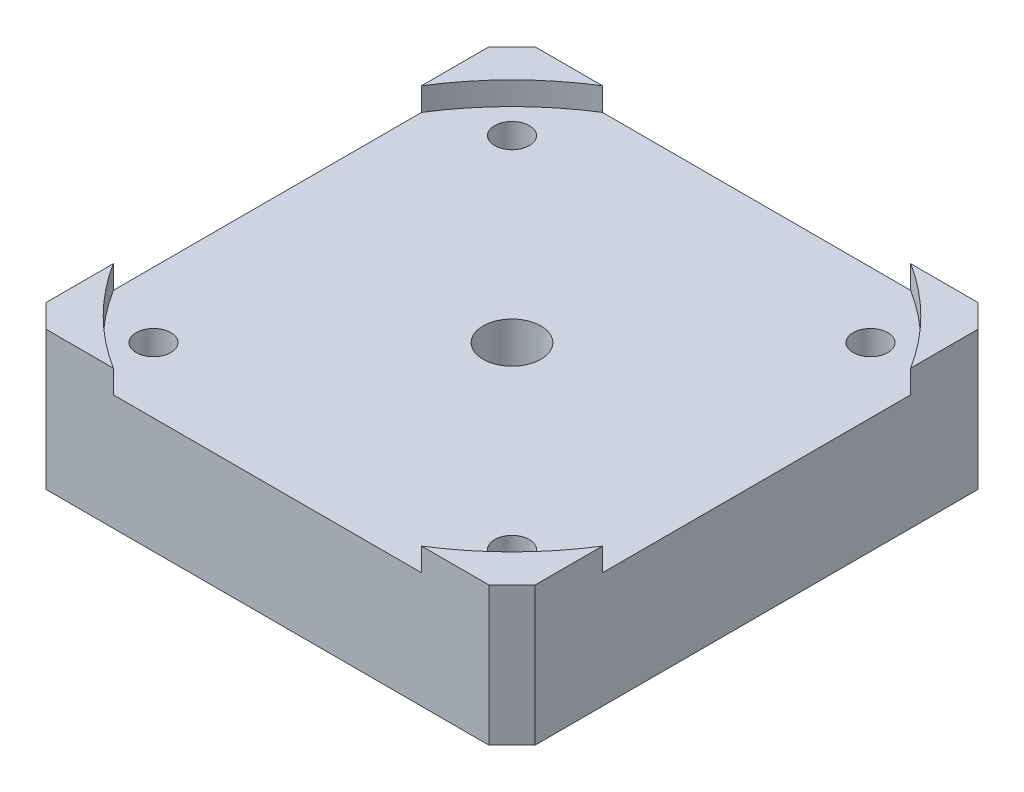
ISO-10303-21;
HEADER;
FILE_DESCRIPTION(('STEP AP214'),'2;1');
FILE_NAME('part.step','',(''),(''),'','','');
FILE_SCHEMA(('AUTOMOTIVE_DESIGN { 1 0 10303 214 1 1 1 1 }'));
ENDSEC;
DATA;
#1=APPLICATION_CONTEXT('core data for automotive mechanical design processes');
#2=APPLICATION_PROTOCOL_DEFINITION('international standard','automotive_design',2000,#1);
#3=PRODUCT_CONTEXT('',#1,'mechanical');
#4=PRODUCT('Part','Part','',(#3));
#5=PRODUCT_RELATED_PRODUCT_CATEGORY('part','',(#4));
#6=PRODUCT_DEFINITION_FORMATION('','',#4);
#7=PRODUCT_DEFINITION_CONTEXT('part definition',#1,'design');
#8=PRODUCT_DEFINITION('design','',#6,#7);
#9=PRODUCT_DEFINITION_SHAPE('','',#8);
#10=(LENGTH_UNIT() NAMED_UNIT(*) SI_UNIT(.MILLI.,.METRE.));
#11=(NAMED_UNIT(*) PLANE_ANGLE_UNIT() SI_UNIT($,.RADIAN.));
#12=(NAMED_UNIT(*) SI_UNIT($,.STERADIAN.) SOLID_ANGLE_UNIT());
#13=UNCERTAINTY_MEASURE_WITH_UNIT(LENGTH_MEASURE(1.E-05),#10,'distance_accuracy_value','');
#14=(GEOMETRIC_REPRESENTATION_CONTEXT(3) GLOBAL_UNCERTAINTY_ASSIGNED_CONTEXT((#13)) GLOBAL_UNIT_ASSIGNED_CONTEXT((#10,
#11,#12)) REPRESENTATION_CONTEXT('',''));
#15=CARTESIAN_POINT('',(0.,0.,0.));
#16=DIRECTION('',(0.,0.,1.));
#17=DIRECTION('',(1.,0.,0.));
#18=AXIS2_PLACEMENT_3D('',#15,#16,#17);
#19=CARTESIAN_POINT('',(0.,12.,0.));
#20=DIRECTION('',(0.,-1.,0.));
#21=DIRECTION('',(0.,0.,-1.));
#22=AXIS2_PLACEMENT_3D('',#19,#20,#21);
#23=PLANE('',#22);
#24=DIRECTION('',(-1.,0.,0.));
#25=VECTOR('',#24,1.);
#26=CARTESIAN_POINT('',(-21.15,12.,-21.15));
#27=LINE('',#26,#25);
#28=CARTESIAN_POINT('',(-13.3295723862396,12.,-21.15));
#29=VERTEX_POINT('',#28);
#30=CARTESIAN_POINT('',(-19.15,12.,-21.15));
#31=VERTEX_POINT('',#30);
#32=EDGE_CURVE('E229',#29,#31,#27,.T.);
#33=ORIENTED_EDGE('',*,*,#32,.T.);
#34=DIRECTION('',(0.707106781186549,0.,-0.707106781186546));
#35=VECTOR('',#34,1.);
#36=CARTESIAN_POINT('',(-21.15,12.,-19.15));
#37=LINE('',#36,#35);
#38=CARTESIAN_POINT('',(-21.15,12.,-19.15));
#39=VERTEX_POINT('',#38);
#40=EDGE_CURVE('E274',#31,#39,#37,.F.);
#41=ORIENTED_EDGE('',*,*,#40,.T.);
#42=DIRECTION('',(0.,0.,1.));
#43=VECTOR('',#42,1.);
#44=CARTESIAN_POINT('',(-21.15,12.,21.15));
#45=LINE('',#44,#43);
#46=CARTESIAN_POINT('',(-21.15,12.,-13.3295723862396));
#47=VERTEX_POINT('',#46);
#48=EDGE_CURVE('E234',#39,#47,#45,.T.);
#49=ORIENTED_EDGE('',*,*,#48,.T.);
#50=CARTESIAN_POINT('',(0.,12.,0.));
#51=DIRECTION('',(0.,1.,0.));
#52=DIRECTION('',(0.,0.,1.));
#53=AXIS2_PLACEMENT_3D('',#50,#51,#52);
#54=CIRCLE('',#53,25.);
#55=EDGE_CURVE('E163',#29,#47,#54,.T.);
#56=ORIENTED_EDGE('',*,*,#55,.F.);
#57=EDGE_LOOP('',(#33,#41,#49,#56));
#58=FACE_BOUND('',#57,.T.);
#59=ADVANCED_FACE('F41',(#58),#23,.F.);
#60=DIRECTION('',(0.,0.,-1.));
#61=VECTOR('',#60,1.);
#62=CARTESIAN_POINT('',(21.15,12.,21.15));
#63=LINE('',#62,#61);
#64=CARTESIAN_POINT('',(21.15,12.,-13.3295723862396));
#65=VERTEX_POINT('',#64);
#66=CARTESIAN_POINT('',(21.15,12.,-19.15));
#67=VERTEX_POINT('',#66);
#68=EDGE_CURVE('E230',#65,#67,#63,.T.);
#69=ORIENTED_EDGE('',*,*,#68,.T.);
#70=DIRECTION('',(0.707106781186546,0.,0.707106781186549));
#71=VECTOR('',#70,1.);
#72=CARTESIAN_POINT('',(19.15,12.,-21.15));
#73=LINE('',#72,#71);
#74=CARTESIAN_POINT('',(19.15,12.,-21.15));
#75=VERTEX_POINT('',#74);
#76=EDGE_CURVE('E267',#67,#75,#73,.F.);
#77=ORIENTED_EDGE('',*,*,#76,.T.);
#78=CARTESIAN_POINT('',(13.3295723862396,12.,-21.15));
#79=VERTEX_POINT('',#78);
#80=EDGE_CURVE('E231',#75,#79,#27,.T.);
#81=ORIENTED_EDGE('',*,*,#80,.T.);
#82=CARTESIAN_POINT('',(0.,12.,0.));
#83=DIRECTION('',(0.,1.,0.));
#84=DIRECTION('',(0.,0.,1.));
#85=AXIS2_PLACEMENT_3D('',#82,#83,#84);
#86=CIRCLE('',#85,25.);
#87=EDGE_CURVE('E179',#65,#79,#86,.T.);
#88=ORIENTED_EDGE('',*,*,#87,.F.);
#89=EDGE_LOOP('',(#69,#77,#81,#88));
#90=FACE_BOUND('',#89,.T.);
#91=ADVANCED_FACE('F322',(#90),#23,.F.);
#92=DIRECTION('',(1.,0.,0.));
#93=VECTOR('',#92,1.);
#94=CARTESIAN_POINT('',(-21.15,12.,21.15));
#95=LINE('',#94,#93);
#96=CARTESIAN_POINT('',(13.3295723862396,12.,21.15));
#97=VERTEX_POINT('',#96);
#98=CARTESIAN_POINT('',(19.15,12.,21.15));
#99=VERTEX_POINT('',#98);
#100=EDGE_CURVE('E236',#97,#99,#95,.T.);
#101=ORIENTED_EDGE('',*,*,#100,.T.);
#102=DIRECTION('',(-0.707106781186549,0.,0.707106781186546));
#103=VECTOR('',#102,1.);
#104=CARTESIAN_POINT('',(21.15,12.,19.15));
#105=LINE('',#104,#103);
#106=CARTESIAN_POINT('',(21.15,12.,19.15));
#107=VERTEX_POINT('',#106);
#108=EDGE_CURVE('E11',#99,#107,#105,.F.);
#109=ORIENTED_EDGE('',*,*,#108,.T.);
#110=CARTESIAN_POINT('',(21.15,12.,13.3295723862396));
#111=VERTEX_POINT('',#110);
#112=EDGE_CURVE('E227',#107,#111,#63,.T.);
#113=ORIENTED_EDGE('',*,*,#112,.T.);
#114=CARTESIAN_POINT('',(0.,12.,0.));
#115=DIRECTION('',(0.,1.,0.));
#116=DIRECTION('',(0.,0.,1.));
#117=AXIS2_PLACEMENT_3D('',#114,#115,#116);
#118=CIRCLE('',#117,25.);
#119=EDGE_CURVE('E205',#97,#111,#118,.T.);
#120=ORIENTED_EDGE('',*,*,#119,.F.);
#121=EDGE_LOOP('',(#101,#109,#113,#120));
#122=FACE_BOUND('',#121,.T.);
#123=ADVANCED_FACE('F299',(#122),#23,.F.);
#124=CARTESIAN_POINT('',(21.15,12.,21.15));
#125=DIRECTION('',(-1.,0.,0.));
#126=DIRECTION('',(0.,0.,1.));
#127=AXIS2_PLACEMENT_3D('',#124,#125,#126);
#128=PLANE('',#127);
#129=DIRECTION('',(0.,0.,-1.));
#130=VECTOR('',#129,1.);
#131=CARTESIAN_POINT('',(21.15,0.,21.15));
#132=LINE('',#131,#130);
#133=CARTESIAN_POINT('',(21.15,0.,19.15));
#134=VERTEX_POINT('',#133);
#135=CARTESIAN_POINT('',(21.15,0.,-19.15));
#136=VERTEX_POINT('',#135);
#137=EDGE_CURVE('E212',#134,#136,#132,.T.);
#138=ORIENTED_EDGE('',*,*,#137,.T.);
#139=DIRECTION('',(0.,1.,0.));
#140=VECTOR('',#139,1.);
#141=CARTESIAN_POINT('',(21.15,12.,-19.15));
#142=LINE('',#141,#140);
#143=EDGE_CURVE('E265',#136,#67,#142,.T.);
#144=ORIENTED_EDGE('',*,*,#143,.T.);
#145=ORIENTED_EDGE('',*,*,#68,.F.);
#146=DIRECTION('',(0.,1.,0.));
#147=VECTOR('',#146,1.);
#148=CARTESIAN_POINT('',(21.15,10.,-13.3295723862396));
#149=LINE('',#148,#147);
#150=CARTESIAN_POINT('',(21.15,10.,-13.3295723862396));
#151=VERTEX_POINT('',#150);
#152=EDGE_CURVE('E216',#151,#65,#149,.T.);
#153=ORIENTED_EDGE('',*,*,#152,.F.);
#154=DIRECTION('',(0.,0.,-1.));
#155=VECTOR('',#154,1.);
#156=CARTESIAN_POINT('',(21.15,10.,-13.3295723862396));
#157=LINE('',#156,#155);
#158=CARTESIAN_POINT('',(21.15,10.,13.3295723862396));
#159=VERTEX_POINT('',#158);
#160=EDGE_CURVE('E194',#159,#151,#157,.T.);
#161=ORIENTED_EDGE('',*,*,#160,.F.);
#162=DIRECTION('',(0.,1.,0.));
#163=VECTOR('',#162,1.);
#164=CARTESIAN_POINT('',(21.15,10.,13.3295723862396));
#165=LINE('',#164,#163);
#166=EDGE_CURVE('E218',#159,#111,#165,.T.);
#167=ORIENTED_EDGE('',*,*,#166,.T.);
#168=ORIENTED_EDGE('',*,*,#112,.F.);
#169=DIRECTION('',(0.,-1.,0.));
#170=VECTOR('',#169,1.);
#171=CARTESIAN_POINT('',(21.15,12.,19.15));
#172=LINE('',#171,#170);
#173=EDGE_CURVE('E262',#107,#134,#172,.T.);
#174=ORIENTED_EDGE('',*,*,#173,.T.);
#175=EDGE_LOOP('',(#138,#144,#145,#153,#161,#167,#168,#174));
#176=FACE_BOUND('',#175,.T.);
#177=ADVANCED_FACE('F294',(#176),#128,.F.);
#178=CARTESIAN_POINT('',(-21.15,12.,-21.15));
#179=DIRECTION('',(0.,0.,1.));
#180=DIRECTION('',(1.,0.,0.));
#181=AXIS2_PLACEMENT_3D('',#178,#179,#180);
#182=PLANE('',#181);
#183=ORIENTED_EDGE('',*,*,#80,.F.);
#184=DIRECTION('',(0.,-1.,0.));
#185=VECTOR('',#184,1.);
#186=CARTESIAN_POINT('',(19.15,12.,-21.15));
#187=LINE('',#186,#185);
#188=CARTESIAN_POINT('',(19.15,0.,-21.15));
#189=VERTEX_POINT('',#188);
#190=EDGE_CURVE('E251',#75,#189,#187,.T.);
#191=ORIENTED_EDGE('',*,*,#190,.T.);
#192=DIRECTION('',(-1.,0.,0.));
#193=VECTOR('',#192,1.);
#194=CARTESIAN_POINT('',(-21.15,0.,-21.15));
#195=LINE('',#194,#193);
#196=CARTESIAN_POINT('',(-19.15,0.,-21.15));
#197=VERTEX_POINT('',#196);
#198=EDGE_CURVE('E242',#189,#197,#195,.T.);
#199=ORIENTED_EDGE('',*,*,#198,.T.);
#200=DIRECTION('',(0.,1.,0.));
#201=VECTOR('',#200,1.);
#202=CARTESIAN_POINT('',(-19.15,12.,-21.15));
#203=LINE('',#202,#201);
#204=EDGE_CURVE('E239',#197,#31,#203,.T.);
#205=ORIENTED_EDGE('',*,*,#204,.T.);
#206=ORIENTED_EDGE('',*,*,#32,.F.);
#207=DIRECTION('',(0.,1.,0.));
#208=VECTOR('',#207,1.);
#209=CARTESIAN_POINT('',(-13.3295723862396,10.,-21.15));
#210=LINE('',#209,#208);
#211=CARTESIAN_POINT('',(-13.3295723862396,10.,-21.15));
#212=VERTEX_POINT('',#211);
#213=EDGE_CURVE('E210',#212,#29,#210,.T.);
#214=ORIENTED_EDGE('',*,*,#213,.F.);
#215=DIRECTION('',(-1.,0.,0.));
#216=VECTOR('',#215,1.);
#217=CARTESIAN_POINT('',(-13.3295723862396,10.,-21.15));
#218=LINE('',#217,#216);
#219=CARTESIAN_POINT('',(13.3295723862396,10.,-21.15));
#220=VERTEX_POINT('',#219);
#221=EDGE_CURVE('E168',#220,#212,#218,.T.);
#222=ORIENTED_EDGE('',*,*,#221,.F.);
#223=DIRECTION('',(0.,1.,0.));
#224=VECTOR('',#223,1.);
#225=CARTESIAN_POINT('',(13.3295723862396,10.,-21.15));
#226=LINE('',#225,#224);
#227=EDGE_CURVE('E213',#220,#79,#226,.T.);
#228=ORIENTED_EDGE('',*,*,#227,.T.);
#229=EDGE_LOOP('',(#183,#191,#199,#205,#206,#214,#222,#228));
#230=FACE_BOUND('',#229,.T.);
#231=ADVANCED_FACE('F344',(#230),#182,.F.);
#232=CARTESIAN_POINT('',(-21.15,12.,21.15));
#233=DIRECTION('',(1.,0.,0.));
#234=DIRECTION('',(0.,0.,-1.));
#235=AXIS2_PLACEMENT_3D('',#232,#233,#234);
#236=PLANE('',#235);
#237=ORIENTED_EDGE('',*,*,#48,.F.);
#238=DIRECTION('',(0.,-1.,0.));
#239=VECTOR('',#238,1.);
#240=CARTESIAN_POINT('',(-21.15,12.,-19.15));
#241=LINE('',#240,#239);
#242=CARTESIAN_POINT('',(-21.15,0.,-19.15));
#243=VERTEX_POINT('',#242);
#244=EDGE_CURVE('E271',#39,#243,#241,.T.);
#245=ORIENTED_EDGE('',*,*,#244,.T.);
#246=DIRECTION('',(0.,0.,1.));
#247=VECTOR('',#246,1.);
#248=CARTESIAN_POINT('',(-21.15,0.,21.15));
#249=LINE('',#248,#247);
#250=CARTESIAN_POINT('',(-21.15,0.,19.15));
#251=VERTEX_POINT('',#250);
#252=EDGE_CURVE('E245',#243,#251,#249,.T.);
#253=ORIENTED_EDGE('',*,*,#252,.T.);
#254=DIRECTION('',(0.,1.,0.));
#255=VECTOR('',#254,1.);
#256=CARTESIAN_POINT('',(-21.15,12.,19.15));
#257=LINE('',#256,#255);
#258=CARTESIAN_POINT('',(-21.15,12.,19.15));
#259=VERTEX_POINT('',#258);
#260=EDGE_CURVE('E269',#251,#259,#257,.T.);
#261=ORIENTED_EDGE('',*,*,#260,.T.);
#262=CARTESIAN_POINT('',(-21.15,12.,13.3295723862396));
#263=VERTEX_POINT('',#262);
#264=EDGE_CURVE('E233',#263,#259,#45,.T.);
#265=ORIENTED_EDGE('',*,*,#264,.F.);
#266=DIRECTION('',(0.,1.,0.));
#267=VECTOR('',#266,1.);
#268=CARTESIAN_POINT('',(-21.15,10.,13.3295723862396));
#269=LINE('',#268,#267);
#270=CARTESIAN_POINT('',(-21.15,10.,13.3295723862396));
#271=VERTEX_POINT('',#270);
#272=EDGE_CURVE('E167',#271,#263,#269,.T.);
#273=ORIENTED_EDGE('',*,*,#272,.F.);
#274=DIRECTION('',(0.,0.,1.));
#275=VECTOR('',#274,1.);
#276=CARTESIAN_POINT('',(-21.15,10.,-13.3295723862396));
#277=LINE('',#276,#275);
#278=CARTESIAN_POINT('',(-21.15,10.,-13.3295723862396));
#279=VERTEX_POINT('',#278);
#280=EDGE_CURVE('E174',#279,#271,#277,.T.);
#281=ORIENTED_EDGE('',*,*,#280,.F.);
#282=DIRECTION('',(0.,1.,0.));
#283=VECTOR('',#282,1.);
#284=CARTESIAN_POINT('',(-21.15,10.,-13.3295723862396));
#285=LINE('',#284,#283);
#286=EDGE_CURVE('E157',#279,#47,#285,.T.);
#287=ORIENTED_EDGE('',*,*,#286,.T.);
#288=EDGE_LOOP('',(#237,#245,#253,#261,#265,#273,#281,#287));
#289=FACE_BOUND('',#288,.T.);
#290=ADVANCED_FACE('F181',(#289),#236,.F.);
#291=CARTESIAN_POINT('',(-21.15,12.,21.15));
#292=DIRECTION('',(0.,0.,-1.));
#293=DIRECTION('',(-1.,0.,0.));
#294=AXIS2_PLACEMENT_3D('',#291,#292,#293);
#295=PLANE('',#294);
#296=CARTESIAN_POINT('',(-19.15,12.,21.15));
#297=VERTEX_POINT('',#296);
#298=CARTESIAN_POINT('',(-13.3295723862396,12.,21.15));
#299=VERTEX_POINT('',#298);
#300=EDGE_CURVE('E237',#297,#299,#95,.T.);
#301=ORIENTED_EDGE('',*,*,#300,.F.);
#302=DIRECTION('',(0.,-1.,0.));
#303=VECTOR('',#302,1.);
#304=CARTESIAN_POINT('',(-19.15,12.,21.15));
#305=LINE('',#304,#303);
#306=CARTESIAN_POINT('',(-19.15,0.,21.15));
#307=VERTEX_POINT('',#306);
#308=EDGE_CURVE('E277',#297,#307,#305,.T.);
#309=ORIENTED_EDGE('',*,*,#308,.T.);
#310=DIRECTION('',(1.,0.,0.));
#311=VECTOR('',#310,1.);
#312=CARTESIAN_POINT('',(-21.15,0.,21.15));
#313=LINE('',#312,#311);
#314=CARTESIAN_POINT('',(19.15,0.,21.15));
#315=VERTEX_POINT('',#314);
#316=EDGE_CURVE('E248',#307,#315,#313,.T.);
#317=ORIENTED_EDGE('',*,*,#316,.T.);
#318=DIRECTION('',(0.,1.,0.));
#319=VECTOR('',#318,1.);
#320=CARTESIAN_POINT('',(19.15,12.,21.15));
#321=LINE('',#320,#319);
#322=EDGE_CURVE('E65',#315,#99,#321,.T.);
#323=ORIENTED_EDGE('',*,*,#322,.T.);
#324=ORIENTED_EDGE('',*,*,#100,.F.);
#325=DIRECTION('',(0.,1.,0.));
#326=VECTOR('',#325,1.);
#327=CARTESIAN_POINT('',(13.3295723862396,10.,21.15));
#328=LINE('',#327,#326);
#329=CARTESIAN_POINT('',(13.3295723862396,10.,21.15));
#330=VERTEX_POINT('',#329);
#331=EDGE_CURVE('E221',#330,#97,#328,.T.);
#332=ORIENTED_EDGE('',*,*,#331,.F.);
#333=DIRECTION('',(1.,0.,0.));
#334=VECTOR('',#333,1.);
#335=CARTESIAN_POINT('',(-13.3295723862396,10.,21.15));
#336=LINE('',#335,#334);
#337=CARTESIAN_POINT('',(-13.3295723862396,10.,21.15));
#338=VERTEX_POINT('',#337);
#339=EDGE_CURVE('E185',#338,#330,#336,.T.);
#340=ORIENTED_EDGE('',*,*,#339,.F.);
#341=DIRECTION('',(0.,1.,0.));
#342=VECTOR('',#341,1.);
#343=CARTESIAN_POINT('',(-13.3295723862396,10.,21.15));
#344=LINE('',#343,#342);
#345=EDGE_CURVE('E223',#338,#299,#344,.T.);
#346=ORIENTED_EDGE('',*,*,#345,.T.);
#347=EDGE_LOOP('',(#301,#309,#317,#323,#324,#332,#340,#346));
#348=FACE_BOUND('',#347,.T.);
#349=ADVANCED_FACE('F282',(#348),#295,.F.);
#350=ORIENTED_EDGE('',*,*,#264,.T.);
#351=DIRECTION('',(-0.707106781186546,0.,-0.707106781186549));
#352=VECTOR('',#351,1.);
#353=CARTESIAN_POINT('',(-19.15,12.,21.15));
#354=LINE('',#353,#352);
#355=EDGE_CURVE('E51',#259,#297,#354,.F.);
#356=ORIENTED_EDGE('',*,*,#355,.T.);
#357=ORIENTED_EDGE('',*,*,#300,.T.);
#358=CARTESIAN_POINT('',(0.,12.,0.));
#359=DIRECTION('',(0.,1.,0.));
#360=DIRECTION('',(0.,0.,1.));
#361=AXIS2_PLACEMENT_3D('',#358,#359,#360);
#362=CIRCLE('',#361,25.);
#363=EDGE_CURVE('E201',#263,#299,#362,.T.);
#364=ORIENTED_EDGE('',*,*,#363,.F.);
#365=EDGE_LOOP('',(#350,#356,#357,#364));
#366=FACE_BOUND('',#365,.T.);
#367=ADVANCED_FACE('F307',(#366),#23,.F.);
#368=CARTESIAN_POINT('',(0.,0.,0.));
#369=DIRECTION('',(0.,-1.,0.));
#370=DIRECTION('',(0.,0.,-1.));
#371=AXIS2_PLACEMENT_3D('',#368,#369,#370);
#372=PLANE('',#371);
#373=CARTESIAN_POINT('',(0.,0.,0.));
#374=DIRECTION('',(0.,-1.,0.));
#375=DIRECTION('',(0.,0.,-1.));
#376=AXIS2_PLACEMENT_3D('',#373,#374,#375);
#377=CIRCLE('',#376,12.);
#378=CARTESIAN_POINT('',(0.,0.,-12.));
#379=VERTEX_POINT('',#378);
#380=EDGE_CURVE('E492',#379,#379,#377,.T.);
#381=ORIENTED_EDGE('',*,*,#380,.F.);
#382=EDGE_LOOP('',(#381));
#383=FACE_BOUND('',#382,.T.);
#384=CARTESIAN_POINT('',(15.5,0.,15.5));
#385=DIRECTION('',(0.,-1.,0.));
#386=DIRECTION('',(0.,0.,1.));
#387=AXIS2_PLACEMENT_3D('',#384,#385,#386);
#388=CIRCLE('',#387,1.5);
#389=CARTESIAN_POINT('',(15.5,0.,17.));
#390=VERTEX_POINT('',#389);
#391=EDGE_CURVE('E477',#390,#390,#388,.T.);
#392=ORIENTED_EDGE('',*,*,#391,.F.);
#393=EDGE_LOOP('',(#392));
#394=FACE_BOUND('',#393,.T.);
#395=CARTESIAN_POINT('',(15.5,0.,-15.5));
#396=DIRECTION('',(0.,-1.,0.));
#397=DIRECTION('',(0.,0.,1.));
#398=AXIS2_PLACEMENT_3D('',#395,#396,#397);
#399=CIRCLE('',#398,1.5);
#400=CARTESIAN_POINT('',(15.5,0.,-14.));
#401=VERTEX_POINT('',#400);
#402=EDGE_CURVE('E484',#401,#401,#399,.T.);
#403=ORIENTED_EDGE('',*,*,#402,.F.);
#404=EDGE_LOOP('',(#403));
#405=FACE_BOUND('',#404,.T.);
#406=CARTESIAN_POINT('',(-15.5,0.,-15.5));
#407=DIRECTION('',(0.,-1.,0.));
#408=DIRECTION('',(0.,0.,-1.));
#409=AXIS2_PLACEMENT_3D('',#406,#407,#408);
#410=CIRCLE('',#409,1.5);
#411=CARTESIAN_POINT('',(-15.5,0.,-17.));
#412=VERTEX_POINT('',#411);
#413=EDGE_CURVE('E474',#412,#412,#410,.T.);
#414=ORIENTED_EDGE('',*,*,#413,.F.);
#415=EDGE_LOOP('',(#414));
#416=FACE_BOUND('',#415,.T.);
#417=CARTESIAN_POINT('',(-15.5,0.,15.5));
#418=DIRECTION('',(0.,-1.,0.));
#419=DIRECTION('',(0.,0.,-1.));
#420=AXIS2_PLACEMENT_3D('',#417,#418,#419);
#421=CIRCLE('',#420,1.5);
#422=CARTESIAN_POINT('',(-15.5,0.,14.));
#423=VERTEX_POINT('',#422);
#424=EDGE_CURVE('E469',#423,#423,#421,.T.);
#425=ORIENTED_EDGE('',*,*,#424,.F.);
#426=EDGE_LOOP('',(#425));
#427=FACE_BOUND('',#426,.T.);
#428=ORIENTED_EDGE('',*,*,#198,.F.);
#429=DIRECTION('',(-0.707106781186546,0.,-0.707106781186549));
#430=VECTOR('',#429,1.);
#431=CARTESIAN_POINT('',(20.15,0.,-20.15));
#432=LINE('',#431,#430);
#433=EDGE_CURVE('E260',#189,#136,#432,.F.);
#434=ORIENTED_EDGE('',*,*,#433,.T.);
#435=ORIENTED_EDGE('',*,*,#137,.F.);
#436=DIRECTION('',(0.707106781186549,0.,-0.707106781186546));
#437=VECTOR('',#436,1.);
#438=CARTESIAN_POINT('',(20.15,0.,20.15));
#439=LINE('',#438,#437);
#440=EDGE_CURVE('E254',#134,#315,#439,.F.);
#441=ORIENTED_EDGE('',*,*,#440,.T.);
#442=ORIENTED_EDGE('',*,*,#316,.F.);
#443=DIRECTION('',(0.707106781186546,0.,0.707106781186549));
#444=VECTOR('',#443,1.);
#445=CARTESIAN_POINT('',(-20.15,0.,20.15));
#446=LINE('',#445,#444);
#447=EDGE_CURVE('E256',#307,#251,#446,.F.);
#448=ORIENTED_EDGE('',*,*,#447,.T.);
#449=ORIENTED_EDGE('',*,*,#252,.F.);
#450=DIRECTION('',(-0.707106781186549,0.,0.707106781186546));
#451=VECTOR('',#450,1.);
#452=CARTESIAN_POINT('',(-20.15,0.,-20.15));
#453=LINE('',#452,#451);
#454=EDGE_CURVE('E258',#243,#197,#453,.F.);
#455=ORIENTED_EDGE('',*,*,#454,.T.);
#456=EDGE_LOOP('',(#428,#434,#435,#441,#442,#448,#449,#455));
#457=FACE_BOUND('',#456,.T.);
#458=ADVANCED_FACE('F286',(#383,#394,#405,#416,#427,#457),#372,.T.);
#459=CARTESIAN_POINT('',(0.,10.,0.));
#460=DIRECTION('',(0.,1.,0.));
#461=DIRECTION('',(0.,0.,1.));
#462=AXIS2_PLACEMENT_3D('',#459,#460,#461);
#463=CYLINDRICAL_SURFACE('',#462,25.);
#464=ORIENTED_EDGE('',*,*,#55,.T.);
#465=ORIENTED_EDGE('',*,*,#286,.F.);
#466=CARTESIAN_POINT('',(0.,10.,0.));
#467=DIRECTION('',(0.,1.,0.));
#468=DIRECTION('',(0.,0.,1.));
#469=AXIS2_PLACEMENT_3D('',#466,#467,#468);
#470=CIRCLE('',#469,25.);
#471=EDGE_CURVE('E160',#212,#279,#470,.T.);
#472=ORIENTED_EDGE('',*,*,#471,.F.);
#473=ORIENTED_EDGE('',*,*,#213,.T.);
#474=EDGE_LOOP('',(#464,#465,#472,#473));
#475=FACE_BOUND('',#474,.T.);
#476=ADVANCED_FACE('F159',(#475),#463,.F.);
#477=CARTESIAN_POINT('',(0.,10.,0.));
#478=DIRECTION('',(0.,1.,0.));
#479=DIRECTION('',(0.,0.,1.));
#480=AXIS2_PLACEMENT_3D('',#477,#478,#479);
#481=CYLINDRICAL_SURFACE('',#480,25.);
#482=ORIENTED_EDGE('',*,*,#87,.T.);
#483=ORIENTED_EDGE('',*,*,#227,.F.);
#484=CARTESIAN_POINT('',(0.,10.,0.));
#485=DIRECTION('',(0.,1.,0.));
#486=DIRECTION('',(0.,0.,1.));
#487=AXIS2_PLACEMENT_3D('',#484,#485,#486);
#488=CIRCLE('',#487,25.);
#489=EDGE_CURVE('E197',#151,#220,#488,.T.);
#490=ORIENTED_EDGE('',*,*,#489,.F.);
#491=ORIENTED_EDGE('',*,*,#152,.T.);
#492=EDGE_LOOP('',(#482,#483,#490,#491));
#493=FACE_BOUND('',#492,.T.);
#494=ADVANCED_FACE('F378',(#493),#481,.F.);
#495=CARTESIAN_POINT('',(0.,10.,0.));
#496=DIRECTION('',(0.,1.,0.));
#497=DIRECTION('',(0.,0.,1.));
#498=AXIS2_PLACEMENT_3D('',#495,#496,#497);
#499=CYLINDRICAL_SURFACE('',#498,25.);
#500=ORIENTED_EDGE('',*,*,#119,.T.);
#501=ORIENTED_EDGE('',*,*,#166,.F.);
#502=CARTESIAN_POINT('',(0.,10.,0.));
#503=DIRECTION('',(0.,1.,0.));
#504=DIRECTION('',(0.,0.,1.));
#505=AXIS2_PLACEMENT_3D('',#502,#503,#504);
#506=CIRCLE('',#505,25.);
#507=EDGE_CURVE('E191',#330,#159,#506,.T.);
#508=ORIENTED_EDGE('',*,*,#507,.F.);
#509=ORIENTED_EDGE('',*,*,#331,.T.);
#510=EDGE_LOOP('',(#500,#501,#508,#509));
#511=FACE_BOUND('',#510,.T.);
#512=ADVANCED_FACE('F301',(#511),#499,.F.);
#513=CARTESIAN_POINT('',(0.,10.,0.));
#514=DIRECTION('',(0.,1.,0.));
#515=DIRECTION('',(0.,0.,1.));
#516=AXIS2_PLACEMENT_3D('',#513,#514,#515);
#517=CYLINDRICAL_SURFACE('',#516,25.);
#518=ORIENTED_EDGE('',*,*,#363,.T.);
#519=ORIENTED_EDGE('',*,*,#345,.F.);
#520=CARTESIAN_POINT('',(0.,10.,0.));
#521=DIRECTION('',(0.,1.,0.));
#522=DIRECTION('',(0.,0.,1.));
#523=AXIS2_PLACEMENT_3D('',#520,#521,#522);
#524=CIRCLE('',#523,25.);
#525=EDGE_CURVE('E183',#271,#338,#524,.T.);
#526=ORIENTED_EDGE('',*,*,#525,.F.);
#527=ORIENTED_EDGE('',*,*,#272,.T.);
#528=EDGE_LOOP('',(#518,#519,#526,#527));
#529=FACE_BOUND('',#528,.T.);
#530=ADVANCED_FACE('F305',(#529),#517,.F.);
#531=CARTESIAN_POINT('',(0.,10.,0.));
#532=DIRECTION('',(0.,1.,0.));
#533=DIRECTION('',(0.,0.,1.));
#534=AXIS2_PLACEMENT_3D('',#531,#532,#533);
#535=PLANE('',#534);
#536=CARTESIAN_POINT('',(0.,10.,0.));
#537=DIRECTION('',(0.,1.,0.));
#538=DIRECTION('',(0.,0.,1.));
#539=AXIS2_PLACEMENT_3D('',#536,#537,#538);
#540=CIRCLE('',#539,2.5);
#541=CARTESIAN_POINT('',(0.,10.,2.5));
#542=VERTEX_POINT('',#541);
#543=EDGE_CURVE('E46',#542,#542,#540,.T.);
#544=ORIENTED_EDGE('',*,*,#543,.F.);
#545=EDGE_LOOP('',(#544));
#546=FACE_BOUND('',#545,.T.);
#547=CARTESIAN_POINT('',(15.5,10.,15.5));
#548=DIRECTION('',(0.,-1.,0.));
#549=DIRECTION('',(0.,0.,1.));
#550=AXIS2_PLACEMENT_3D('',#547,#548,#549);
#551=CIRCLE('',#550,1.5);
#552=CARTESIAN_POINT('',(15.5,10.,17.));
#553=VERTEX_POINT('',#552);
#554=EDGE_CURVE('E480',#553,#553,#551,.T.);
#555=ORIENTED_EDGE('',*,*,#554,.T.);
#556=EDGE_LOOP('',(#555));
#557=FACE_BOUND('',#556,.T.);
#558=CARTESIAN_POINT('',(15.5,10.,-15.5));
#559=DIRECTION('',(0.,-1.,0.));
#560=DIRECTION('',(0.,0.,1.));
#561=AXIS2_PLACEMENT_3D('',#558,#559,#560);
#562=CIRCLE('',#561,1.5);
#563=CARTESIAN_POINT('',(15.5,10.,-14.));
#564=VERTEX_POINT('',#563);
#565=EDGE_CURVE('E487',#564,#564,#562,.T.);
#566=ORIENTED_EDGE('',*,*,#565,.T.);
#567=EDGE_LOOP('',(#566));
#568=FACE_BOUND('',#567,.T.);
#569=CARTESIAN_POINT('',(-15.5,10.,-15.5));
#570=DIRECTION('',(0.,-1.,0.));
#571=DIRECTION('',(0.,0.,-1.));
#572=AXIS2_PLACEMENT_3D('',#569,#570,#571);
#573=CIRCLE('',#572,1.5);
#574=CARTESIAN_POINT('',(-15.5,10.,-17.));
#575=VERTEX_POINT('',#574);
#576=EDGE_CURVE('E471',#575,#575,#573,.T.);
#577=ORIENTED_EDGE('',*,*,#576,.T.);
#578=EDGE_LOOP('',(#577));
#579=FACE_BOUND('',#578,.T.);
#580=CARTESIAN_POINT('',(-15.5,10.,15.5));
#581=DIRECTION('',(0.,-1.,0.));
#582=DIRECTION('',(0.,0.,-1.));
#583=AXIS2_PLACEMENT_3D('',#580,#581,#582);
#584=CIRCLE('',#583,1.5);
#585=CARTESIAN_POINT('',(-15.5,10.,14.));
#586=VERTEX_POINT('',#585);
#587=EDGE_CURVE('E202',#586,#586,#584,.T.);
#588=ORIENTED_EDGE('',*,*,#587,.T.);
#589=EDGE_LOOP('',(#588));
#590=FACE_BOUND('',#589,.T.);
#591=ORIENTED_EDGE('',*,*,#471,.T.);
#592=ORIENTED_EDGE('',*,*,#280,.T.);
#593=ORIENTED_EDGE('',*,*,#525,.T.);
#594=ORIENTED_EDGE('',*,*,#339,.T.);
#595=ORIENTED_EDGE('',*,*,#507,.T.);
#596=ORIENTED_EDGE('',*,*,#160,.T.);
#597=ORIENTED_EDGE('',*,*,#489,.T.);
#598=ORIENTED_EDGE('',*,*,#221,.T.);
#599=EDGE_LOOP('',(#591,#592,#593,#594,#595,#596,#597,#598));
#600=FACE_BOUND('',#599,.T.);
#601=ADVANCED_FACE('F172',(#546,#557,#568,#579,#590,#600),#535,.T.);
#602=CARTESIAN_POINT('',(19.15,12.,-21.15));
#603=DIRECTION('',(-0.707106781186549,0.,0.707106781186546));
#604=DIRECTION('',(0.,-1.,0.));
#605=AXIS2_PLACEMENT_3D('',#602,#603,#604);
#606=PLANE('',#605);
#607=ORIENTED_EDGE('',*,*,#76,.F.);
#608=ORIENTED_EDGE('',*,*,#143,.F.);
#609=ORIENTED_EDGE('',*,*,#433,.F.);
#610=ORIENTED_EDGE('',*,*,#190,.F.);
#611=EDGE_LOOP('',(#607,#608,#609,#610));
#612=FACE_BOUND('',#611,.T.);
#613=ADVANCED_FACE('F317',(#612),#606,.F.);
#614=CARTESIAN_POINT('',(-21.15,12.,-19.15));
#615=DIRECTION('',(0.707106781186546,0.,0.707106781186549));
#616=DIRECTION('',(0.,-1.,0.));
#617=AXIS2_PLACEMENT_3D('',#614,#615,#616);
#618=PLANE('',#617);
#619=ORIENTED_EDGE('',*,*,#40,.F.);
#620=ORIENTED_EDGE('',*,*,#204,.F.);
#621=ORIENTED_EDGE('',*,*,#454,.F.);
#622=ORIENTED_EDGE('',*,*,#244,.F.);
#623=EDGE_LOOP('',(#619,#620,#621,#622));
#624=FACE_BOUND('',#623,.T.);
#625=ADVANCED_FACE('F311',(#624),#618,.F.);
#626=CARTESIAN_POINT('',(-19.15,12.,21.15));
#627=DIRECTION('',(0.707106781186549,0.,-0.707106781186546));
#628=DIRECTION('',(0.,-1.,0.));
#629=AXIS2_PLACEMENT_3D('',#626,#627,#628);
#630=PLANE('',#629);
#631=ORIENTED_EDGE('',*,*,#355,.F.);
#632=ORIENTED_EDGE('',*,*,#260,.F.);
#633=ORIENTED_EDGE('',*,*,#447,.F.);
#634=ORIENTED_EDGE('',*,*,#308,.F.);
#635=EDGE_LOOP('',(#631,#632,#633,#634));
#636=FACE_BOUND('',#635,.T.);
#637=ADVANCED_FACE('F309',(#636),#630,.F.);
#638=CARTESIAN_POINT('',(21.15,12.,19.15));
#639=DIRECTION('',(-0.707106781186546,0.,-0.707106781186549));
#640=DIRECTION('',(0.,-1.,0.));
#641=AXIS2_PLACEMENT_3D('',#638,#639,#640);
#642=PLANE('',#641);
#643=ORIENTED_EDGE('',*,*,#108,.F.);
#644=ORIENTED_EDGE('',*,*,#322,.F.);
#645=ORIENTED_EDGE('',*,*,#440,.F.);
#646=ORIENTED_EDGE('',*,*,#173,.F.);
#647=EDGE_LOOP('',(#643,#644,#645,#646));
#648=FACE_BOUND('',#647,.T.);
#649=ADVANCED_FACE('F44',(#648),#642,.F.);
#650=CARTESIAN_POINT('',(-15.5,10.,15.5));
#651=DIRECTION('',(0.,-1.,0.));
#652=DIRECTION('',(0.,0.,-1.));
#653=AXIS2_PLACEMENT_3D('',#650,#651,#652);
#654=CYLINDRICAL_SURFACE('',#653,1.5);
#655=ORIENTED_EDGE('',*,*,#587,.F.);
#656=EDGE_LOOP('',(#655));
#657=FACE_BOUND('',#656,.T.);
#658=ORIENTED_EDGE('',*,*,#424,.T.);
#659=EDGE_LOOP('',(#658));
#660=FACE_BOUND('',#659,.T.);
#661=ADVANCED_FACE('F316',(#657,#660),#654,.F.);
#662=CARTESIAN_POINT('',(-15.5,10.,-15.5));
#663=DIRECTION('',(0.,-1.,0.));
#664=DIRECTION('',(0.,0.,-1.));
#665=AXIS2_PLACEMENT_3D('',#662,#663,#664);
#666=CYLINDRICAL_SURFACE('',#665,1.5);
#667=ORIENTED_EDGE('',*,*,#576,.F.);
#668=EDGE_LOOP('',(#667));
#669=FACE_BOUND('',#668,.T.);
#670=ORIENTED_EDGE('',*,*,#413,.T.);
#671=EDGE_LOOP('',(#670));
#672=FACE_BOUND('',#671,.T.);
#673=ADVANCED_FACE('F450',(#669,#672),#666,.F.);
#674=CARTESIAN_POINT('',(15.5,10.,-15.5));
#675=DIRECTION('',(0.,-1.,0.));
#676=DIRECTION('',(0.,0.,-1.));
#677=AXIS2_PLACEMENT_3D('',#674,#675,#676);
#678=CYLINDRICAL_SURFACE('',#677,1.5);
#679=ORIENTED_EDGE('',*,*,#565,.F.);
#680=EDGE_LOOP('',(#679));
#681=FACE_BOUND('',#680,.T.);
#682=ORIENTED_EDGE('',*,*,#402,.T.);
#683=EDGE_LOOP('',(#682));
#684=FACE_BOUND('',#683,.T.);
#685=ADVANCED_FACE('F453',(#681,#684),#678,.F.);
#686=CARTESIAN_POINT('',(15.5,10.,15.5));
#687=DIRECTION('',(0.,-1.,0.));
#688=DIRECTION('',(0.,0.,-1.));
#689=AXIS2_PLACEMENT_3D('',#686,#687,#688);
#690=CYLINDRICAL_SURFACE('',#689,1.5);
#691=ORIENTED_EDGE('',*,*,#554,.F.);
#692=EDGE_LOOP('',(#691));
#693=FACE_BOUND('',#692,.T.);
#694=ORIENTED_EDGE('',*,*,#391,.T.);
#695=EDGE_LOOP('',(#694));
#696=FACE_BOUND('',#695,.T.);
#697=ADVANCED_FACE('F448',(#693,#696),#690,.F.);
#698=CARTESIAN_POINT('',(0.,2.,0.));
#699=DIRECTION('',(0.,-1.,0.));
#700=DIRECTION('',(0.,0.,-1.));
#701=AXIS2_PLACEMENT_3D('',#698,#699,#700);
#702=CYLINDRICAL_SURFACE('',#701,12.);
#703=CARTESIAN_POINT('',(0.,2.,0.));
#704=DIRECTION('',(0.,-1.,0.));
#705=DIRECTION('',(0.,0.,-1.));
#706=AXIS2_PLACEMENT_3D('',#703,#704,#705);
#707=CIRCLE('',#706,12.);
#708=CARTESIAN_POINT('',(0.,2.,-12.));
#709=VERTEX_POINT('',#708);
#710=EDGE_CURVE('E481',#709,#709,#707,.T.);
#711=ORIENTED_EDGE('',*,*,#710,.F.);
#712=EDGE_LOOP('',(#711));
#713=FACE_BOUND('',#712,.T.);
#714=ORIENTED_EDGE('',*,*,#380,.T.);
#715=EDGE_LOOP('',(#714));
#716=FACE_BOUND('',#715,.T.);
#717=ADVANCED_FACE('F444',(#713,#716),#702,.F.);
#718=CARTESIAN_POINT('',(0.,2.,0.));
#719=DIRECTION('',(0.,-1.,0.));
#720=DIRECTION('',(0.,0.,-1.));
#721=AXIS2_PLACEMENT_3D('',#718,#719,#720);
#722=PLANE('',#721);
#723=CARTESIAN_POINT('',(0.,2.,0.));
#724=DIRECTION('',(0.,-1.,0.));
#725=DIRECTION('',(0.,0.,-1.));
#726=AXIS2_PLACEMENT_3D('',#723,#724,#725);
#727=CIRCLE('',#726,11.);
#728=CARTESIAN_POINT('',(0.,2.,-11.));
#729=VERTEX_POINT('',#728);
#730=EDGE_CURVE('E498',#729,#729,#727,.T.);
#731=ORIENTED_EDGE('',*,*,#730,.F.);
#732=EDGE_LOOP('',(#731));
#733=FACE_BOUND('',#732,.T.);
#734=ORIENTED_EDGE('',*,*,#710,.T.);
#735=EDGE_LOOP('',(#734));
#736=FACE_BOUND('',#735,.T.);
#737=ADVANCED_FACE('F440',(#733,#736),#722,.T.);
#738=CARTESIAN_POINT('',(0.,-2.,0.));
#739=DIRECTION('',(0.,1.,0.));
#740=DIRECTION('',(0.,0.,1.));
#741=AXIS2_PLACEMENT_3D('',#738,#739,#740);
#742=CYLINDRICAL_SURFACE('',#741,11.);
#743=CARTESIAN_POINT('',(0.,-2.,0.));
#744=DIRECTION('',(0.,-1.,0.));
#745=DIRECTION('',(0.,0.,-1.));
#746=AXIS2_PLACEMENT_3D('',#743,#744,#745);
#747=CIRCLE('',#746,11.);
#748=CARTESIAN_POINT('',(0.,-2.,-11.));
#749=VERTEX_POINT('',#748);
#750=EDGE_CURVE('E495',#749,#749,#747,.T.);
#751=ORIENTED_EDGE('',*,*,#750,.F.);
#752=EDGE_LOOP('',(#751));
#753=FACE_BOUND('',#752,.T.);
#754=ORIENTED_EDGE('',*,*,#730,.T.);
#755=EDGE_LOOP('',(#754));
#756=FACE_BOUND('',#755,.T.);
#757=ADVANCED_FACE('F436',(#753,#756),#742,.T.);
#758=CARTESIAN_POINT('',(0.,-2.,0.));
#759=DIRECTION('',(0.,-1.,0.));
#760=DIRECTION('',(0.,0.,-1.));
#761=AXIS2_PLACEMENT_3D('',#758,#759,#760);
#762=PLANE('',#761);
#763=CARTESIAN_POINT('',(0.,-2.,0.));
#764=DIRECTION('',(0.,-1.,0.));
#765=DIRECTION('',(0.,0.,-1.));
#766=AXIS2_PLACEMENT_3D('',#763,#764,#765);
#767=CIRCLE('',#766,3.5);
#768=CARTESIAN_POINT('',(0.,-2.,-3.5));
#769=VERTEX_POINT('',#768);
#770=EDGE_CURVE('E504',#769,#769,#767,.T.);
#771=ORIENTED_EDGE('',*,*,#770,.F.);
#772=EDGE_LOOP('',(#771));
#773=FACE_BOUND('',#772,.T.);
#774=ORIENTED_EDGE('',*,*,#750,.T.);
#775=EDGE_LOOP('',(#774));
#776=FACE_BOUND('',#775,.T.);
#777=ADVANCED_FACE('F432',(#773,#776),#762,.T.);
#778=CARTESIAN_POINT('',(0.,0.,0.));
#779=DIRECTION('',(0.,-1.,0.));
#780=DIRECTION('',(0.,0.,-1.));
#781=AXIS2_PLACEMENT_3D('',#778,#779,#780);
#782=CYLINDRICAL_SURFACE('',#781,3.5);
#783=CARTESIAN_POINT('',(0.,0.,0.));
#784=DIRECTION('',(0.,-1.,0.));
#785=DIRECTION('',(0.,0.,-1.));
#786=AXIS2_PLACEMENT_3D('',#783,#784,#785);
#787=CIRCLE('',#786,3.5);
#788=CARTESIAN_POINT('',(0.,0.,-3.5));
#789=VERTEX_POINT('',#788);
#790=EDGE_CURVE('E501',#789,#789,#787,.T.);
#791=ORIENTED_EDGE('',*,*,#790,.F.);
#792=EDGE_LOOP('',(#791));
#793=FACE_BOUND('',#792,.T.);
#794=ORIENTED_EDGE('',*,*,#770,.T.);
#795=EDGE_LOOP('',(#794));
#796=FACE_BOUND('',#795,.T.);
#797=ADVANCED_FACE('F404',(#793,#796),#782,.F.);
#798=CARTESIAN_POINT('',(0.,0.,0.));
#799=DIRECTION('',(0.,-1.,0.));
#800=DIRECTION('',(0.,0.,-1.));
#801=AXIS2_PLACEMENT_3D('',#798,#799,#800);
#802=PLANE('',#801);
#803=CARTESIAN_POINT('',(0.,0.,0.));
#804=DIRECTION('',(0.,-1.,0.));
#805=DIRECTION('',(0.,0.,-1.));
#806=AXIS2_PLACEMENT_3D('',#803,#804,#805);
#807=CIRCLE('',#806,2.5);
#808=CARTESIAN_POINT('',(0.,0.,-2.5));
#809=VERTEX_POINT('',#808);
#810=EDGE_CURVE('E509',#809,#809,#807,.T.);
#811=ORIENTED_EDGE('',*,*,#810,.F.);
#812=EDGE_LOOP('',(#811));
#813=FACE_BOUND('',#812,.T.);
#814=ORIENTED_EDGE('',*,*,#790,.T.);
#815=EDGE_LOOP('',(#814));
#816=FACE_BOUND('',#815,.T.);
#817=ADVANCED_FACE('F409',(#813,#816),#802,.T.);
#818=CARTESIAN_POINT('',(0.,12.,0.));
#819=DIRECTION('',(0.,-1.,0.));
#820=DIRECTION('',(0.,0.,-1.));
#821=AXIS2_PLACEMENT_3D('',#818,#819,#820);
#822=CYLINDRICAL_SURFACE('',#821,2.5);
#823=ORIENTED_EDGE('',*,*,#543,.T.);
#824=EDGE_LOOP('',(#823));
#825=FACE_BOUND('',#824,.T.);
#826=ORIENTED_EDGE('',*,*,#810,.T.);
#827=EDGE_LOOP('',(#826));
#828=FACE_BOUND('',#827,.T.);
#829=ADVANCED_FACE('F414',(#825,#828),#822,.F.);
#830=CLOSED_SHELL('',(#59,#91,#123,#177,#231,#290,#349,#367,#458,#476,#494,#512,#530,#601,#613,
#625,#637,#649,#661,#673,#685,#697,#717,#737,#757,#777,#797,#817,#829));
#831=MANIFOLD_SOLID_BREP('B2',#830);
#832=ADVANCED_BREP_SHAPE_REPRESENTATION('',(#18,#831),#14);
#833=SHAPE_DEFINITION_REPRESENTATION(#9,#832);
ENDSEC;
END-ISO-10303-21;
